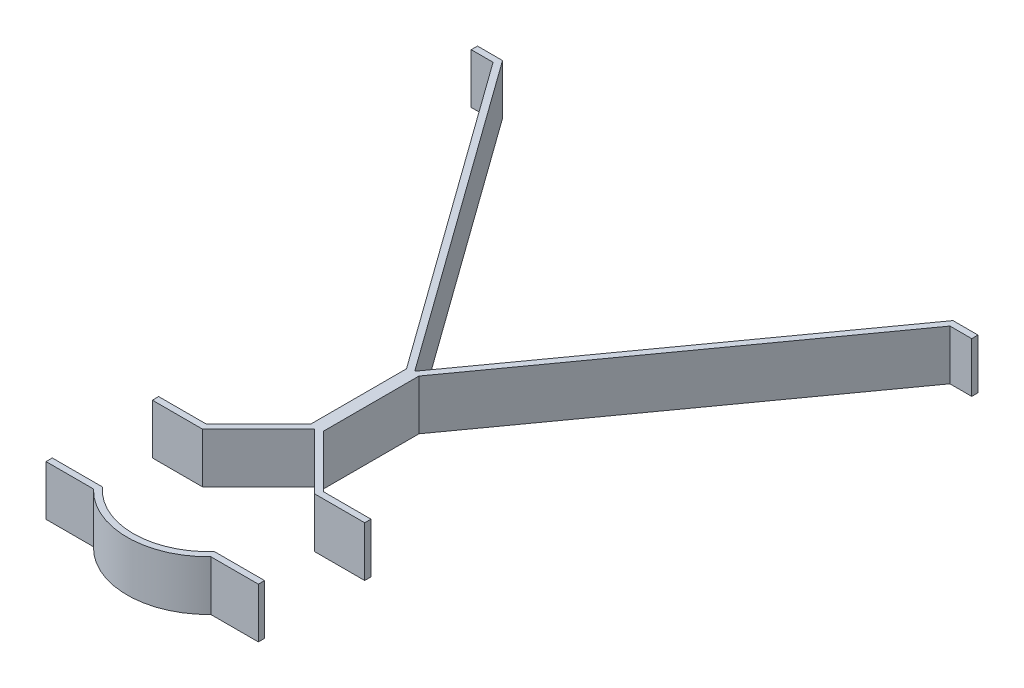
ISO-10303-21;
HEADER;
FILE_DESCRIPTION(('STEP AP214'),'2;1');
FILE_NAME('part.step','',(''),(''),'','','');
FILE_SCHEMA(('AUTOMOTIVE_DESIGN { 1 0 10303 214 1 1 1 1 }'));
ENDSEC;
DATA;
#1=APPLICATION_CONTEXT('core data for automotive mechanical design processes');
#2=APPLICATION_PROTOCOL_DEFINITION('international standard','automotive_design',2000,#1);
#3=PRODUCT_CONTEXT('',#1,'mechanical');
#4=PRODUCT('Part','Part','',(#3));
#5=PRODUCT_RELATED_PRODUCT_CATEGORY('part','',(#4));
#6=PRODUCT_DEFINITION_FORMATION('','',#4);
#7=PRODUCT_DEFINITION_CONTEXT('part definition',#1,'design');
#8=PRODUCT_DEFINITION('design','',#6,#7);
#9=PRODUCT_DEFINITION_SHAPE('','',#8);
#10=(LENGTH_UNIT() NAMED_UNIT(*) SI_UNIT(.MILLI.,.METRE.));
#11=(NAMED_UNIT(*) PLANE_ANGLE_UNIT() SI_UNIT($,.RADIAN.));
#12=(NAMED_UNIT(*) SI_UNIT($,.STERADIAN.) SOLID_ANGLE_UNIT());
#13=UNCERTAINTY_MEASURE_WITH_UNIT(LENGTH_MEASURE(1.E-05),#10,'distance_accuracy_value','');
#14=(GEOMETRIC_REPRESENTATION_CONTEXT(3) GLOBAL_UNCERTAINTY_ASSIGNED_CONTEXT((#13)) GLOBAL_UNIT_ASSIGNED_CONTEXT((#10,
#11,#12)) REPRESENTATION_CONTEXT('',''));
#15=CARTESIAN_POINT('',(0.,0.,0.));
#16=DIRECTION('',(0.,0.,1.));
#17=DIRECTION('',(1.,0.,0.));
#18=AXIS2_PLACEMENT_3D('',#15,#16,#17);
#19=CARTESIAN_POINT('',(0.,12.7,107.856536726415));
#20=DIRECTION('',(0.,0.,-1.));
#21=DIRECTION('',(-1.,0.,0.));
#22=AXIS2_PLACEMENT_3D('',#19,#20,#21);
#23=PLANE('',#22);
#24=DIRECTION('',(1.,0.,0.));
#25=VECTOR('',#24,1.);
#26=CARTESIAN_POINT('',(0.,-12.7,107.856536726415));
#27=LINE('',#26,#25);
#28=CARTESIAN_POINT('',(-53.8815367264149,-12.7,107.856536726415));
#29=VERTEX_POINT('',#28);
#30=CARTESIAN_POINT('',(-29.7841400748788,-12.7,107.856536726415));
#31=VERTEX_POINT('',#30);
#32=EDGE_CURVE('E140',#29,#31,#27,.T.);
#33=ORIENTED_EDGE('',*,*,#32,.T.);
#34=DIRECTION('',(0.,-1.,0.));
#35=VECTOR('',#34,1.);
#36=CARTESIAN_POINT('',(-29.7841400748788,12.7,107.856536726415));
#37=LINE('',#36,#35);
#38=CARTESIAN_POINT('',(-29.7841400748788,12.7,107.856536726415));
#39=VERTEX_POINT('',#38);
#40=EDGE_CURVE('E12',#39,#31,#37,.T.);
#41=ORIENTED_EDGE('',*,*,#40,.F.);
#42=DIRECTION('',(1.,0.,0.));
#43=VECTOR('',#42,1.);
#44=CARTESIAN_POINT('',(0.,12.7,107.856536726415));
#45=LINE('',#44,#43);
#46=CARTESIAN_POINT('',(-53.8815367264149,12.7,107.856536726415));
#47=VERTEX_POINT('',#46);
#48=EDGE_CURVE('E158',#47,#39,#45,.T.);
#49=ORIENTED_EDGE('',*,*,#48,.F.);
#50=DIRECTION('',(0.,-1.,0.));
#51=VECTOR('',#50,1.);
#52=CARTESIAN_POINT('',(-53.8815367264149,12.7,107.856536726415));
#53=LINE('',#52,#51);
#54=EDGE_CURVE('E136',#47,#29,#53,.T.);
#55=ORIENTED_EDGE('',*,*,#54,.T.);
#56=EDGE_LOOP('',(#33,#41,#49,#55));
#57=FACE_BOUND('',#56,.T.);
#58=ADVANCED_FACE('F45',(#57),#23,.F.);
#59=CARTESIAN_POINT('',(0.,12.7,79.2815367264148));
#60=DIRECTION('',(0.,-1.,0.));
#61=DIRECTION('',(0.,0.,-1.));
#62=AXIS2_PLACEMENT_3D('',#59,#60,#61);
#63=CYLINDRICAL_SURFACE('',#62,41.275);
#64=CARTESIAN_POINT('',(0.,-12.7,79.2815367264148));
#65=DIRECTION('',(0.,1.,0.));
#66=DIRECTION('',(0.,0.,1.));
#67=AXIS2_PLACEMENT_3D('',#64,#65,#66);
#68=CIRCLE('',#67,41.275);
#69=CARTESIAN_POINT('',(29.7841400748787,-12.7,107.856536726415));
#70=VERTEX_POINT('',#69);
#71=EDGE_CURVE('E143',#31,#70,#68,.T.);
#72=ORIENTED_EDGE('',*,*,#71,.T.);
#73=DIRECTION('',(0.,-1.,0.));
#74=VECTOR('',#73,1.);
#75=CARTESIAN_POINT('',(29.7841400748787,12.7,107.856536726415));
#76=LINE('',#75,#74);
#77=CARTESIAN_POINT('',(29.7841400748787,12.7,107.856536726415));
#78=VERTEX_POINT('',#77);
#79=EDGE_CURVE('E53',#78,#70,#76,.T.);
#80=ORIENTED_EDGE('',*,*,#79,.F.);
#81=CARTESIAN_POINT('',(0.,12.7,79.2815367264148));
#82=DIRECTION('',(0.,1.,0.));
#83=DIRECTION('',(0.,0.,1.));
#84=AXIS2_PLACEMENT_3D('',#81,#82,#83);
#85=CIRCLE('',#84,41.275);
#86=EDGE_CURVE('E100',#39,#78,#85,.T.);
#87=ORIENTED_EDGE('',*,*,#86,.F.);
#88=ORIENTED_EDGE('',*,*,#40,.T.);
#89=EDGE_LOOP('',(#72,#80,#87,#88));
#90=FACE_BOUND('',#89,.T.);
#91=ADVANCED_FACE('F188',(#90),#63,.T.);
#92=CARTESIAN_POINT('',(0.,12.7,107.856536726415));
#93=DIRECTION('',(0.,0.,-1.));
#94=DIRECTION('',(-1.,0.,0.));
#95=AXIS2_PLACEMENT_3D('',#92,#93,#94);
#96=PLANE('',#95);
#97=DIRECTION('',(1.,0.,0.));
#98=VECTOR('',#97,1.);
#99=CARTESIAN_POINT('',(0.,-12.7,107.856536726415));
#100=LINE('',#99,#98);
#101=CARTESIAN_POINT('',(53.8815367264149,-12.7,107.856536726415));
#102=VERTEX_POINT('',#101);
#103=EDGE_CURVE('E145',#70,#102,#100,.T.);
#104=ORIENTED_EDGE('',*,*,#103,.T.);
#105=DIRECTION('',(0.,-1.,0.));
#106=VECTOR('',#105,1.);
#107=CARTESIAN_POINT('',(53.8815367264149,12.7,107.856536726415));
#108=LINE('',#107,#106);
#109=CARTESIAN_POINT('',(53.8815367264149,12.7,107.856536726415));
#110=VERTEX_POINT('',#109);
#111=EDGE_CURVE('E164',#110,#102,#108,.T.);
#112=ORIENTED_EDGE('',*,*,#111,.F.);
#113=DIRECTION('',(1.,0.,0.));
#114=VECTOR('',#113,1.);
#115=CARTESIAN_POINT('',(0.,12.7,107.856536726415));
#116=LINE('',#115,#114);
#117=EDGE_CURVE('E171',#78,#110,#116,.T.);
#118=ORIENTED_EDGE('',*,*,#117,.F.);
#119=ORIENTED_EDGE('',*,*,#79,.T.);
#120=EDGE_LOOP('',(#104,#112,#118,#119));
#121=FACE_BOUND('',#120,.T.);
#122=ADVANCED_FACE('F169',(#121),#96,.F.);
#123=CARTESIAN_POINT('',(53.8815367264149,12.7,0.));
#124=DIRECTION('',(1.,0.,0.));
#125=DIRECTION('',(0.,0.,-1.));
#126=AXIS2_PLACEMENT_3D('',#123,#124,#125);
#127=PLANE('',#126);
#128=DIRECTION('',(0.,0.,1.));
#129=VECTOR('',#128,1.);
#130=CARTESIAN_POINT('',(53.8815367264149,-12.7,0.));
#131=LINE('',#130,#129);
#132=CARTESIAN_POINT('',(53.8815367264149,-12.7,104.681536726415));
#133=VERTEX_POINT('',#132);
#134=EDGE_CURVE('E148',#133,#102,#131,.T.);
#135=ORIENTED_EDGE('',*,*,#134,.F.);
#136=DIRECTION('',(0.,-1.,0.));
#137=VECTOR('',#136,1.);
#138=CARTESIAN_POINT('',(53.8815367264149,12.7,104.681536726415));
#139=LINE('',#138,#137);
#140=CARTESIAN_POINT('',(53.8815367264149,12.7,104.681536726415));
#141=VERTEX_POINT('',#140);
#142=EDGE_CURVE('E162',#141,#133,#139,.T.);
#143=ORIENTED_EDGE('',*,*,#142,.F.);
#144=DIRECTION('',(0.,0.,1.));
#145=VECTOR('',#144,1.);
#146=CARTESIAN_POINT('',(53.8815367264149,12.7,0.));
#147=LINE('',#146,#145);
#148=EDGE_CURVE('E180',#141,#110,#147,.T.);
#149=ORIENTED_EDGE('',*,*,#148,.T.);
#150=ORIENTED_EDGE('',*,*,#111,.T.);
#151=EDGE_LOOP('',(#135,#143,#149,#150));
#152=FACE_BOUND('',#151,.T.);
#153=ADVANCED_FACE('F178',(#152),#127,.T.);
#154=CARTESIAN_POINT('',(0.,12.7,104.681536726415));
#155=DIRECTION('',(0.,0.,-1.));
#156=DIRECTION('',(-1.,0.,0.));
#157=AXIS2_PLACEMENT_3D('',#154,#155,#156);
#158=PLANE('',#157);
#159=DIRECTION('',(1.,0.,0.));
#160=VECTOR('',#159,1.);
#161=CARTESIAN_POINT('',(0.,-12.7,104.681536726415));
#162=LINE('',#161,#160);
#163=CARTESIAN_POINT('',(28.3980633142473,-12.7,104.681536726415));
#164=VERTEX_POINT('',#163);
#165=EDGE_CURVE('E151',#164,#133,#162,.T.);
#166=ORIENTED_EDGE('',*,*,#165,.F.);
#167=DIRECTION('',(0.,-1.,0.));
#168=VECTOR('',#167,1.);
#169=CARTESIAN_POINT('',(28.3980633142473,12.7,104.681536726415));
#170=LINE('',#169,#168);
#171=CARTESIAN_POINT('',(28.3980633142473,12.7,104.681536726415));
#172=VERTEX_POINT('',#171);
#173=EDGE_CURVE('E125',#172,#164,#170,.T.);
#174=ORIENTED_EDGE('',*,*,#173,.F.);
#175=DIRECTION('',(1.,0.,0.));
#176=VECTOR('',#175,1.);
#177=CARTESIAN_POINT('',(0.,12.7,104.681536726415));
#178=LINE('',#177,#176);
#179=EDGE_CURVE('E132',#172,#141,#178,.T.);
#180=ORIENTED_EDGE('',*,*,#179,.T.);
#181=ORIENTED_EDGE('',*,*,#142,.T.);
#182=EDGE_LOOP('',(#166,#174,#180,#181));
#183=FACE_BOUND('',#182,.T.);
#184=ADVANCED_FACE('F198',(#183),#158,.T.);
#185=CARTESIAN_POINT('',(0.,12.7,79.2815367264148));
#186=DIRECTION('',(0.,-1.,0.));
#187=DIRECTION('',(0.,0.,-1.));
#188=AXIS2_PLACEMENT_3D('',#185,#186,#187);
#189=CYLINDRICAL_SURFACE('',#188,38.1);
#190=CARTESIAN_POINT('',(0.,-12.7,79.2815367264148));
#191=DIRECTION('',(0.,1.,0.));
#192=DIRECTION('',(0.,0.,1.));
#193=AXIS2_PLACEMENT_3D('',#190,#191,#192);
#194=CIRCLE('',#193,38.1);
#195=CARTESIAN_POINT('',(-28.3980633142473,-12.7,104.681536726415));
#196=VERTEX_POINT('',#195);
#197=EDGE_CURVE('E120',#196,#164,#194,.T.);
#198=ORIENTED_EDGE('',*,*,#197,.F.);
#199=DIRECTION('',(0.,-1.,0.));
#200=VECTOR('',#199,1.);
#201=CARTESIAN_POINT('',(-28.3980633142473,12.7,104.681536726415));
#202=LINE('',#201,#200);
#203=CARTESIAN_POINT('',(-28.3980633142473,12.7,104.681536726415));
#204=VERTEX_POINT('',#203);
#205=EDGE_CURVE('E115',#204,#196,#202,.T.);
#206=ORIENTED_EDGE('',*,*,#205,.F.);
#207=CARTESIAN_POINT('',(0.,12.7,79.2815367264148));
#208=DIRECTION('',(0.,1.,0.));
#209=DIRECTION('',(0.,0.,1.));
#210=AXIS2_PLACEMENT_3D('',#207,#208,#209);
#211=CIRCLE('',#210,38.1);
#212=EDGE_CURVE('E118',#204,#172,#211,.T.);
#213=ORIENTED_EDGE('',*,*,#212,.T.);
#214=ORIENTED_EDGE('',*,*,#173,.T.);
#215=EDGE_LOOP('',(#198,#206,#213,#214));
#216=FACE_BOUND('',#215,.T.);
#217=ADVANCED_FACE('F117',(#216),#189,.F.);
#218=CARTESIAN_POINT('',(0.,12.7,104.681536726415));
#219=DIRECTION('',(0.,0.,-1.));
#220=DIRECTION('',(-1.,0.,0.));
#221=AXIS2_PLACEMENT_3D('',#218,#219,#220);
#222=PLANE('',#221);
#223=DIRECTION('',(1.,0.,0.));
#224=VECTOR('',#223,1.);
#225=CARTESIAN_POINT('',(0.,-12.7,104.681536726415));
#226=LINE('',#225,#224);
#227=CARTESIAN_POINT('',(-53.8815367264149,-12.7,104.681536726415));
#228=VERTEX_POINT('',#227);
#229=EDGE_CURVE('E155',#228,#196,#226,.T.);
#230=ORIENTED_EDGE('',*,*,#229,.F.);
#231=DIRECTION('',(0.,-1.,0.));
#232=VECTOR('',#231,1.);
#233=CARTESIAN_POINT('',(-53.8815367264149,12.7,104.681536726415));
#234=LINE('',#233,#232);
#235=CARTESIAN_POINT('',(-53.8815367264149,12.7,104.681536726415));
#236=VERTEX_POINT('',#235);
#237=EDGE_CURVE('E89',#236,#228,#234,.T.);
#238=ORIENTED_EDGE('',*,*,#237,.F.);
#239=DIRECTION('',(1.,0.,0.));
#240=VECTOR('',#239,1.);
#241=CARTESIAN_POINT('',(0.,12.7,104.681536726415));
#242=LINE('',#241,#240);
#243=EDGE_CURVE('E129',#236,#204,#242,.T.);
#244=ORIENTED_EDGE('',*,*,#243,.T.);
#245=ORIENTED_EDGE('',*,*,#205,.T.);
#246=EDGE_LOOP('',(#230,#238,#244,#245));
#247=FACE_BOUND('',#246,.T.);
#248=ADVANCED_FACE('F134',(#247),#222,.T.);
#249=CARTESIAN_POINT('',(-53.8815367264149,12.7,0.));
#250=DIRECTION('',(1.,0.,0.));
#251=DIRECTION('',(0.,0.,-1.));
#252=AXIS2_PLACEMENT_3D('',#249,#250,#251);
#253=PLANE('',#252);
#254=DIRECTION('',(0.,0.,1.));
#255=VECTOR('',#254,1.);
#256=CARTESIAN_POINT('',(-53.8815367264149,-12.7,0.));
#257=LINE('',#256,#255);
#258=EDGE_CURVE('E92',#228,#29,#257,.T.);
#259=ORIENTED_EDGE('',*,*,#258,.T.);
#260=ORIENTED_EDGE('',*,*,#54,.F.);
#261=DIRECTION('',(0.,0.,1.));
#262=VECTOR('',#261,1.);
#263=CARTESIAN_POINT('',(-53.8815367264149,12.7,0.));
#264=LINE('',#263,#262);
#265=EDGE_CURVE('E61',#236,#47,#264,.T.);
#266=ORIENTED_EDGE('',*,*,#265,.F.);
#267=ORIENTED_EDGE('',*,*,#237,.T.);
#268=EDGE_LOOP('',(#259,#260,#266,#267));
#269=FACE_BOUND('',#268,.T.);
#270=ADVANCED_FACE('F206',(#269),#253,.F.);
#271=CARTESIAN_POINT('',(0.,12.7,0.));
#272=DIRECTION('',(0.,1.,0.));
#273=DIRECTION('',(0.,0.,1.));
#274=AXIS2_PLACEMENT_3D('',#271,#272,#273);
#275=PLANE('',#274);
#276=ORIENTED_EDGE('',*,*,#48,.T.);
#277=ORIENTED_EDGE('',*,*,#86,.T.);
#278=ORIENTED_EDGE('',*,*,#117,.T.);
#279=ORIENTED_EDGE('',*,*,#148,.F.);
#280=ORIENTED_EDGE('',*,*,#179,.F.);
#281=ORIENTED_EDGE('',*,*,#212,.F.);
#282=ORIENTED_EDGE('',*,*,#243,.F.);
#283=ORIENTED_EDGE('',*,*,#265,.T.);
#284=EDGE_LOOP('',(#276,#277,#278,#279,#280,#281,#282,#283));
#285=FACE_BOUND('',#284,.T.);
#286=ADVANCED_FACE('F128',(#285),#275,.T.);
#287=CARTESIAN_POINT('',(0.,-12.7,0.));
#288=DIRECTION('',(0.,1.,0.));
#289=DIRECTION('',(0.,0.,1.));
#290=AXIS2_PLACEMENT_3D('',#287,#288,#289);
#291=PLANE('',#290);
#292=ORIENTED_EDGE('',*,*,#32,.F.);
#293=ORIENTED_EDGE('',*,*,#258,.F.);
#294=ORIENTED_EDGE('',*,*,#229,.T.);
#295=ORIENTED_EDGE('',*,*,#197,.T.);
#296=ORIENTED_EDGE('',*,*,#165,.T.);
#297=ORIENTED_EDGE('',*,*,#134,.T.);
#298=ORIENTED_EDGE('',*,*,#103,.F.);
#299=ORIENTED_EDGE('',*,*,#71,.F.);
#300=EDGE_LOOP('',(#292,#293,#294,#295,#296,#297,#298,#299));
#301=FACE_BOUND('',#300,.T.);
#302=ADVANCED_FACE('F174',(#301),#291,.F.);
#303=CLOSED_SHELL('',(#58,#91,#122,#153,#184,#217,#248,#270,#286,#302));
#304=MANIFOLD_SOLID_BREP('B2',#303);
#305=CARTESIAN_POINT('',(-10.4549359697327,12.7,10.4549359697327));
#306=DIRECTION('',(0.707106781186548,0.,-0.707106781186548));
#307=DIRECTION('',(-0.707106781186548,0.,-0.707106781186548));
#308=AXIS2_PLACEMENT_3D('',#305,#306,#307);
#309=PLANE('',#308);
#310=DIRECTION('',(0.707106781186548,0.,0.707106781186548));
#311=VECTOR('',#310,1.);
#312=CARTESIAN_POINT('',(-10.4549359697327,-12.7,10.4549359697327));
#313=LINE('',#312,#311);
#314=CARTESIAN_POINT('',(3.175,-12.7,24.0848719394654));
#315=VERTEX_POINT('',#314);
#316=CARTESIAN_POINT('',(29.7966647869494,-12.7,50.7065367264148));
#317=VERTEX_POINT('',#316);
#318=EDGE_CURVE('E452',#315,#317,#313,.T.);
#319=ORIENTED_EDGE('',*,*,#318,.F.);
#320=DIRECTION('',(0.,-1.,0.));
#321=VECTOR('',#320,1.);
#322=CARTESIAN_POINT('',(3.175,12.7,24.0848719394654));
#323=LINE('',#322,#321);
#324=CARTESIAN_POINT('',(3.175,12.7,24.0848719394654));
#325=VERTEX_POINT('',#324);
#326=EDGE_CURVE('E43',#325,#315,#323,.T.);
#327=ORIENTED_EDGE('',*,*,#326,.F.);
#328=DIRECTION('',(0.707106781186548,0.,0.707106781186548));
#329=VECTOR('',#328,1.);
#330=CARTESIAN_POINT('',(-10.4549359697327,12.7,10.4549359697327));
#331=LINE('',#330,#329);
#332=CARTESIAN_POINT('',(29.7966647869494,12.7,50.7065367264148));
#333=VERTEX_POINT('',#332);
#334=EDGE_CURVE('E509',#325,#333,#331,.T.);
#335=ORIENTED_EDGE('',*,*,#334,.T.);
#336=DIRECTION('',(0.,-1.,0.));
#337=VECTOR('',#336,1.);
#338=CARTESIAN_POINT('',(29.7966647869494,12.7,50.7065367264148));
#339=LINE('',#338,#337);
#340=EDGE_CURVE('E289',#333,#317,#339,.T.);
#341=ORIENTED_EDGE('',*,*,#340,.T.);
#342=EDGE_LOOP('',(#319,#327,#335,#341));
#343=FACE_BOUND('',#342,.T.);
#344=ADVANCED_FACE('F273',(#343),#309,.T.);
#345=CARTESIAN_POINT('',(3.175,12.7,0.));
#346=DIRECTION('',(-1.,0.,0.));
#347=DIRECTION('',(0.,0.,1.));
#348=AXIS2_PLACEMENT_3D('',#345,#346,#347);
#349=PLANE('',#348);
#350=DIRECTION('',(0.,0.,-1.));
#351=VECTOR('',#350,1.);
#352=CARTESIAN_POINT('',(3.175,-12.7,0.));
#353=LINE('',#352,#351);
#354=CARTESIAN_POINT('',(3.17500000000002,-12.7,-24.37640278133));
#355=VERTEX_POINT('',#354);
#356=EDGE_CURVE('E454',#315,#355,#353,.T.);
#357=ORIENTED_EDGE('',*,*,#356,.T.);
#358=DIRECTION('',(0.,-1.,0.));
#359=VECTOR('',#358,1.);
#360=CARTESIAN_POINT('',(3.17500000000002,12.7,-24.37640278133));
#361=LINE('',#360,#359);
#362=CARTESIAN_POINT('',(3.17500000000002,12.7,-24.37640278133));
#363=VERTEX_POINT('',#362);
#364=EDGE_CURVE('E281',#363,#355,#361,.T.);
#365=ORIENTED_EDGE('',*,*,#364,.F.);
#366=DIRECTION('',(0.,0.,-1.));
#367=VECTOR('',#366,1.);
#368=CARTESIAN_POINT('',(3.175,12.7,0.));
#369=LINE('',#368,#367);
#370=EDGE_CURVE('E570',#325,#363,#369,.T.);
#371=ORIENTED_EDGE('',*,*,#370,.F.);
#372=ORIENTED_EDGE('',*,*,#326,.T.);
#373=EDGE_LOOP('',(#357,#365,#371,#372));
#374=FACE_BOUND('',#373,.T.);
#375=ADVANCED_FACE('F557',(#374),#349,.F.);
#376=CARTESIAN_POINT('',(-9.46486786910494,12.7,-6.81069510285979));
#377=DIRECTION('',(0.811697368777209,0.,0.584078232362888));
#378=DIRECTION('',(0.584078232362888,0.,-0.811697368777209));
#379=AXIS2_PLACEMENT_3D('',#376,#377,#378);
#380=PLANE('',#379);
#381=DIRECTION('',(-0.584078232362888,0.,0.811697368777209));
#382=VECTOR('',#381,1.);
#383=CARTESIAN_POINT('',(-9.46486786910494,-12.7,-6.81069510285979));
#384=LINE('',#383,#382);
#385=CARTESIAN_POINT('',(115.926901432781,-12.7,-181.068463273585));
#386=VERTEX_POINT('',#385);
#387=EDGE_CURVE('E457',#386,#355,#384,.T.);
#388=ORIENTED_EDGE('',*,*,#387,.F.);
#389=DIRECTION('',(0.,-1.,0.));
#390=VECTOR('',#389,1.);
#391=CARTESIAN_POINT('',(115.926901432781,12.7,-181.068463273585));
#392=LINE('',#391,#390);
#393=CARTESIAN_POINT('',(115.926901432781,12.7,-181.068463273585));
#394=VERTEX_POINT('',#393);
#395=EDGE_CURVE('E547',#394,#386,#392,.T.);
#396=ORIENTED_EDGE('',*,*,#395,.F.);
#397=DIRECTION('',(-0.584078232362888,0.,0.811697368777209));
#398=VECTOR('',#397,1.);
#399=CARTESIAN_POINT('',(-9.46486786910494,12.7,-6.81069510285979));
#400=LINE('',#399,#398);
#401=EDGE_CURVE('E554',#394,#363,#400,.T.);
#402=ORIENTED_EDGE('',*,*,#401,.T.);
#403=ORIENTED_EDGE('',*,*,#364,.T.);
#404=EDGE_LOOP('',(#388,#396,#402,#403));
#405=FACE_BOUND('',#404,.T.);
#406=ADVANCED_FACE('F552',(#405),#380,.T.);
#407=CARTESIAN_POINT('',(0.,12.7,-181.068463273585));
#408=DIRECTION('',(0.,0.,1.));
#409=DIRECTION('',(1.,0.,0.));
#410=AXIS2_PLACEMENT_3D('',#407,#408,#409);
#411=PLANE('',#410);
#412=DIRECTION('',(-1.,0.,0.));
#413=VECTOR('',#412,1.);
#414=CARTESIAN_POINT('',(0.,-12.7,-181.068463273585));
#415=LINE('',#414,#413);
#416=CARTESIAN_POINT('',(127.,-12.7,-181.068463273585));
#417=VERTEX_POINT('',#416);
#418=EDGE_CURVE('E460',#417,#386,#415,.T.);
#419=ORIENTED_EDGE('',*,*,#418,.F.);
#420=DIRECTION('',(0.,-1.,0.));
#421=VECTOR('',#420,1.);
#422=CARTESIAN_POINT('',(127.,12.7,-181.068463273585));
#423=LINE('',#422,#421);
#424=CARTESIAN_POINT('',(127.,12.7,-181.068463273585));
#425=VERTEX_POINT('',#424);
#426=EDGE_CURVE('E545',#425,#417,#423,.T.);
#427=ORIENTED_EDGE('',*,*,#426,.F.);
#428=DIRECTION('',(-1.,0.,0.));
#429=VECTOR('',#428,1.);
#430=CARTESIAN_POINT('',(0.,12.7,-181.068463273585));
#431=LINE('',#430,#429);
#432=EDGE_CURVE('E567',#425,#394,#431,.T.);
#433=ORIENTED_EDGE('',*,*,#432,.T.);
#434=ORIENTED_EDGE('',*,*,#395,.T.);
#435=EDGE_LOOP('',(#419,#427,#433,#434));
#436=FACE_BOUND('',#435,.T.);
#437=ADVANCED_FACE('F564',(#436),#411,.T.);
#438=CARTESIAN_POINT('',(127.,12.7,0.));
#439=DIRECTION('',(1.,0.,0.));
#440=DIRECTION('',(0.,0.,-1.));
#441=AXIS2_PLACEMENT_3D('',#438,#439,#440);
#442=PLANE('',#441);
#443=DIRECTION('',(0.,0.,1.));
#444=VECTOR('',#443,1.);
#445=CARTESIAN_POINT('',(127.,-12.7,0.));
#446=LINE('',#445,#444);
#447=CARTESIAN_POINT('',(127.,-12.7,-184.243463273585));
#448=VERTEX_POINT('',#447);
#449=EDGE_CURVE('E463',#448,#417,#446,.T.);
#450=ORIENTED_EDGE('',*,*,#449,.F.);
#451=DIRECTION('',(0.,-1.,0.));
#452=VECTOR('',#451,1.);
#453=CARTESIAN_POINT('',(127.,12.7,-184.243463273585));
#454=LINE('',#453,#452);
#455=CARTESIAN_POINT('',(127.,12.7,-184.243463273585));
#456=VERTEX_POINT('',#455);
#457=EDGE_CURVE('E543',#456,#448,#454,.T.);
#458=ORIENTED_EDGE('',*,*,#457,.F.);
#459=DIRECTION('',(0.,0.,1.));
#460=VECTOR('',#459,1.);
#461=CARTESIAN_POINT('',(127.,12.7,0.));
#462=LINE('',#461,#460);
#463=EDGE_CURVE('E572',#456,#425,#462,.T.);
#464=ORIENTED_EDGE('',*,*,#463,.T.);
#465=ORIENTED_EDGE('',*,*,#426,.T.);
#466=EDGE_LOOP('',(#450,#458,#464,#465));
#467=FACE_BOUND('',#466,.T.);
#468=ADVANCED_FACE('F794',(#467),#442,.T.);
#469=CARTESIAN_POINT('',(0.,12.7,-184.243463273585));
#470=DIRECTION('',(0.,0.,1.));
#471=DIRECTION('',(1.,0.,0.));
#472=AXIS2_PLACEMENT_3D('',#469,#470,#471);
#473=PLANE('',#472);
#474=DIRECTION('',(-1.,0.,0.));
#475=VECTOR('',#474,1.);
#476=CARTESIAN_POINT('',(0.,-12.7,-184.243463273585));
#477=LINE('',#476,#475);
#478=CARTESIAN_POINT('',(114.3,-12.7,-184.243463273585));
#479=VERTEX_POINT('',#478);
#480=EDGE_CURVE('E466',#448,#479,#477,.T.);
#481=ORIENTED_EDGE('',*,*,#480,.T.);
#482=DIRECTION('',(0.,-1.,0.));
#483=VECTOR('',#482,1.);
#484=CARTESIAN_POINT('',(114.3,12.7,-184.243463273585));
#485=LINE('',#484,#483);
#486=CARTESIAN_POINT('',(114.3,12.7,-184.243463273585));
#487=VERTEX_POINT('',#486);
#488=EDGE_CURVE('E540',#487,#479,#485,.T.);
#489=ORIENTED_EDGE('',*,*,#488,.F.);
#490=DIRECTION('',(-1.,0.,0.));
#491=VECTOR('',#490,1.);
#492=CARTESIAN_POINT('',(0.,12.7,-184.243463273585));
#493=LINE('',#492,#491);
#494=EDGE_CURVE('E578',#456,#487,#493,.T.);
#495=ORIENTED_EDGE('',*,*,#494,.F.);
#496=ORIENTED_EDGE('',*,*,#457,.T.);
#497=EDGE_LOOP('',(#481,#489,#495,#496));
#498=FACE_BOUND('',#497,.T.);
#499=ADVANCED_FACE('F784',(#498),#473,.F.);
#500=CARTESIAN_POINT('',(-12.0420070149726,12.7,-8.66514349061196));
#501=DIRECTION('',(0.811697368777209,0.,0.584078232362888));
#502=DIRECTION('',(0.584078232362888,0.,-0.811697368777209));
#503=AXIS2_PLACEMENT_3D('',#500,#501,#502);
#504=PLANE('',#503);
#505=DIRECTION('',(-0.584078232362888,0.,0.811697368777209));
#506=VECTOR('',#505,1.);
#507=CARTESIAN_POINT('',(-12.0420070149726,-12.7,-8.66514349061196));
#508=LINE('',#507,#506);
#509=CARTESIAN_POINT('',(0.,-12.7,-25.4));
#510=VERTEX_POINT('',#509);
#511=EDGE_CURVE('E468',#479,#510,#508,.T.);
#512=ORIENTED_EDGE('',*,*,#511,.T.);
#513=DIRECTION('',(0.,-1.,0.));
#514=VECTOR('',#513,1.);
#515=CARTESIAN_POINT('',(0.,12.7,-25.4));
#516=LINE('',#515,#514);
#517=CARTESIAN_POINT('',(0.,12.7,-25.4));
#518=VERTEX_POINT('',#517);
#519=EDGE_CURVE('E538',#518,#510,#516,.T.);
#520=ORIENTED_EDGE('',*,*,#519,.F.);
#521=DIRECTION('',(-0.584078232362888,0.,0.811697368777209));
#522=VECTOR('',#521,1.);
#523=CARTESIAN_POINT('',(-12.0420070149726,12.7,-8.66514349061196));
#524=LINE('',#523,#522);
#525=EDGE_CURVE('E580',#487,#518,#524,.T.);
#526=ORIENTED_EDGE('',*,*,#525,.F.);
#527=ORIENTED_EDGE('',*,*,#488,.T.);
#528=EDGE_LOOP('',(#512,#520,#526,#527));
#529=FACE_BOUND('',#528,.T.);
#530=ADVANCED_FACE('F774',(#529),#504,.F.);
#531=CARTESIAN_POINT('',(12.0420070149726,12.7,-8.66514349061196));
#532=DIRECTION('',(0.811697368777209,0.,-0.584078232362888));
#533=DIRECTION('',(-0.584078232362888,0.,-0.811697368777209));
#534=AXIS2_PLACEMENT_3D('',#531,#532,#533);
#535=PLANE('',#534);
#536=DIRECTION('',(0.584078232362888,0.,0.811697368777209));
#537=VECTOR('',#536,1.);
#538=CARTESIAN_POINT('',(12.0420070149726,-12.7,-8.66514349061196));
#539=LINE('',#538,#537);
#540=CARTESIAN_POINT('',(-114.3,-12.7,-184.243463273585));
#541=VERTEX_POINT('',#540);
#542=EDGE_CURVE('E471',#541,#510,#539,.T.);
#543=ORIENTED_EDGE('',*,*,#542,.F.);
#544=DIRECTION('',(0.,-1.,0.));
#545=VECTOR('',#544,1.);
#546=CARTESIAN_POINT('',(-114.3,12.7,-184.243463273585));
#547=LINE('',#546,#545);
#548=CARTESIAN_POINT('',(-114.3,12.7,-184.243463273585));
#549=VERTEX_POINT('',#548);
#550=EDGE_CURVE('E536',#549,#541,#547,.T.);
#551=ORIENTED_EDGE('',*,*,#550,.F.);
#552=DIRECTION('',(0.584078232362888,0.,0.811697368777209));
#553=VECTOR('',#552,1.);
#554=CARTESIAN_POINT('',(12.0420070149726,12.7,-8.66514349061196));
#555=LINE('',#554,#553);
#556=EDGE_CURVE('E582',#549,#518,#555,.T.);
#557=ORIENTED_EDGE('',*,*,#556,.T.);
#558=ORIENTED_EDGE('',*,*,#519,.T.);
#559=EDGE_LOOP('',(#543,#551,#557,#558));
#560=FACE_BOUND('',#559,.T.);
#561=ADVANCED_FACE('F764',(#560),#535,.T.);
#562=CARTESIAN_POINT('',(0.,12.7,-184.243463273585));
#563=DIRECTION('',(0.,0.,-1.));
#564=DIRECTION('',(-1.,0.,0.));
#565=AXIS2_PLACEMENT_3D('',#562,#563,#564);
#566=PLANE('',#565);
#567=DIRECTION('',(1.,0.,0.));
#568=VECTOR('',#567,1.);
#569=CARTESIAN_POINT('',(0.,-12.7,-184.243463273585));
#570=LINE('',#569,#568);
#571=CARTESIAN_POINT('',(-127.,-12.7,-184.243463273585));
#572=VERTEX_POINT('',#571);
#573=EDGE_CURVE('E474',#572,#541,#570,.T.);
#574=ORIENTED_EDGE('',*,*,#573,.F.);
#575=DIRECTION('',(0.,-1.,0.));
#576=VECTOR('',#575,1.);
#577=CARTESIAN_POINT('',(-127.,12.7,-184.243463273585));
#578=LINE('',#577,#576);
#579=CARTESIAN_POINT('',(-127.,12.7,-184.243463273585));
#580=VERTEX_POINT('',#579);
#581=EDGE_CURVE('E534',#580,#572,#578,.T.);
#582=ORIENTED_EDGE('',*,*,#581,.F.);
#583=DIRECTION('',(1.,0.,0.));
#584=VECTOR('',#583,1.);
#585=CARTESIAN_POINT('',(0.,12.7,-184.243463273585));
#586=LINE('',#585,#584);
#587=EDGE_CURVE('E585',#580,#549,#586,.T.);
#588=ORIENTED_EDGE('',*,*,#587,.T.);
#589=ORIENTED_EDGE('',*,*,#550,.T.);
#590=EDGE_LOOP('',(#574,#582,#588,#589));
#591=FACE_BOUND('',#590,.T.);
#592=ADVANCED_FACE('F754',(#591),#566,.T.);
#593=CARTESIAN_POINT('',(-127.,12.7,0.));
#594=DIRECTION('',(1.,0.,0.));
#595=DIRECTION('',(0.,0.,-1.));
#596=AXIS2_PLACEMENT_3D('',#593,#594,#595);
#597=PLANE('',#596);
#598=DIRECTION('',(0.,0.,1.));
#599=VECTOR('',#598,1.);
#600=CARTESIAN_POINT('',(-127.,-12.7,0.));
#601=LINE('',#600,#599);
#602=CARTESIAN_POINT('',(-127.,-12.7,-181.068463273585));
#603=VERTEX_POINT('',#602);
#604=EDGE_CURVE('E477',#572,#603,#601,.T.);
#605=ORIENTED_EDGE('',*,*,#604,.T.);
#606=DIRECTION('',(0.,-1.,0.));
#607=VECTOR('',#606,1.);
#608=CARTESIAN_POINT('',(-127.,12.7,-181.068463273585));
#609=LINE('',#608,#607);
#610=CARTESIAN_POINT('',(-127.,12.7,-181.068463273585));
#611=VERTEX_POINT('',#610);
#612=EDGE_CURVE('E531',#611,#603,#609,.T.);
#613=ORIENTED_EDGE('',*,*,#612,.F.);
#614=DIRECTION('',(0.,0.,1.));
#615=VECTOR('',#614,1.);
#616=CARTESIAN_POINT('',(-127.,12.7,0.));
#617=LINE('',#616,#615);
#618=EDGE_CURVE('E588',#580,#611,#617,.T.);
#619=ORIENTED_EDGE('',*,*,#618,.F.);
#620=ORIENTED_EDGE('',*,*,#581,.T.);
#621=EDGE_LOOP('',(#605,#613,#619,#620));
#622=FACE_BOUND('',#621,.T.);
#623=ADVANCED_FACE('F744',(#622),#597,.F.);
#624=CARTESIAN_POINT('',(0.,12.7,-181.068463273585));
#625=DIRECTION('',(0.,0.,-1.));
#626=DIRECTION('',(-1.,0.,0.));
#627=AXIS2_PLACEMENT_3D('',#624,#625,#626);
#628=PLANE('',#627);
#629=DIRECTION('',(1.,0.,0.));
#630=VECTOR('',#629,1.);
#631=CARTESIAN_POINT('',(0.,-12.7,-181.068463273585));
#632=LINE('',#631,#630);
#633=CARTESIAN_POINT('',(-115.926901432781,-12.7,-181.068463273585));
#634=VERTEX_POINT('',#633);
#635=EDGE_CURVE('E479',#603,#634,#632,.T.);
#636=ORIENTED_EDGE('',*,*,#635,.T.);
#637=DIRECTION('',(0.,-1.,0.));
#638=VECTOR('',#637,1.);
#639=CARTESIAN_POINT('',(-115.926901432781,12.7,-181.068463273585));
#640=LINE('',#639,#638);
#641=CARTESIAN_POINT('',(-115.926901432781,12.7,-181.068463273585));
#642=VERTEX_POINT('',#641);
#643=EDGE_CURVE('E528',#642,#634,#640,.T.);
#644=ORIENTED_EDGE('',*,*,#643,.F.);
#645=DIRECTION('',(1.,0.,0.));
#646=VECTOR('',#645,1.);
#647=CARTESIAN_POINT('',(0.,12.7,-181.068463273585));
#648=LINE('',#647,#646);
#649=EDGE_CURVE('E590',#611,#642,#648,.T.);
#650=ORIENTED_EDGE('',*,*,#649,.F.);
#651=ORIENTED_EDGE('',*,*,#612,.T.);
#652=EDGE_LOOP('',(#636,#644,#650,#651));
#653=FACE_BOUND('',#652,.T.);
#654=ADVANCED_FACE('F734',(#653),#628,.F.);
#655=CARTESIAN_POINT('',(9.46486786910494,12.7,-6.81069510285979));
#656=DIRECTION('',(0.811697368777209,0.,-0.584078232362888));
#657=DIRECTION('',(-0.584078232362888,0.,-0.811697368777209));
#658=AXIS2_PLACEMENT_3D('',#655,#656,#657);
#659=PLANE('',#658);
#660=DIRECTION('',(0.584078232362888,0.,0.811697368777209));
#661=VECTOR('',#660,1.);
#662=CARTESIAN_POINT('',(9.46486786910494,-12.7,-6.81069510285979));
#663=LINE('',#662,#661);
#664=CARTESIAN_POINT('',(-3.17500000000002,-12.7,-24.37640278133));
#665=VERTEX_POINT('',#664);
#666=EDGE_CURVE('E481',#634,#665,#663,.T.);
#667=ORIENTED_EDGE('',*,*,#666,.T.);
#668=DIRECTION('',(0.,-1.,0.));
#669=VECTOR('',#668,1.);
#670=CARTESIAN_POINT('',(-3.17500000000002,12.7,-24.37640278133));
#671=LINE('',#670,#669);
#672=CARTESIAN_POINT('',(-3.17500000000002,12.7,-24.37640278133));
#673=VERTEX_POINT('',#672);
#674=EDGE_CURVE('E526',#673,#665,#671,.T.);
#675=ORIENTED_EDGE('',*,*,#674,.F.);
#676=DIRECTION('',(0.584078232362888,0.,0.811697368777209));
#677=VECTOR('',#676,1.);
#678=CARTESIAN_POINT('',(9.46486786910494,12.7,-6.81069510285979));
#679=LINE('',#678,#677);
#680=EDGE_CURVE('E592',#642,#673,#679,.T.);
#681=ORIENTED_EDGE('',*,*,#680,.F.);
#682=ORIENTED_EDGE('',*,*,#643,.T.);
#683=EDGE_LOOP('',(#667,#675,#681,#682));
#684=FACE_BOUND('',#683,.T.);
#685=ADVANCED_FACE('F724',(#684),#659,.F.);
#686=CARTESIAN_POINT('',(-3.175,12.7,0.));
#687=DIRECTION('',(-1.,0.,0.));
#688=DIRECTION('',(0.,0.,1.));
#689=AXIS2_PLACEMENT_3D('',#686,#687,#688);
#690=PLANE('',#689);
#691=DIRECTION('',(0.,0.,-1.));
#692=VECTOR('',#691,1.);
#693=CARTESIAN_POINT('',(-3.175,-12.7,0.));
#694=LINE('',#693,#692);
#695=CARTESIAN_POINT('',(-3.175,-12.7,24.0848719394654));
#696=VERTEX_POINT('',#695);
#697=EDGE_CURVE('E484',#696,#665,#694,.T.);
#698=ORIENTED_EDGE('',*,*,#697,.F.);
#699=DIRECTION('',(0.,-1.,0.));
#700=VECTOR('',#699,1.);
#701=CARTESIAN_POINT('',(-3.175,12.7,24.0848719394654));
#702=LINE('',#701,#700);
#703=CARTESIAN_POINT('',(-3.175,12.7,24.0848719394654));
#704=VERTEX_POINT('',#703);
#705=EDGE_CURVE('E524',#704,#696,#702,.T.);
#706=ORIENTED_EDGE('',*,*,#705,.F.);
#707=DIRECTION('',(0.,0.,-1.));
#708=VECTOR('',#707,1.);
#709=CARTESIAN_POINT('',(-3.175,12.7,0.));
#710=LINE('',#709,#708);
#711=EDGE_CURVE('E594',#704,#673,#710,.T.);
#712=ORIENTED_EDGE('',*,*,#711,.T.);
#713=ORIENTED_EDGE('',*,*,#674,.T.);
#714=EDGE_LOOP('',(#698,#706,#712,#713));
#715=FACE_BOUND('',#714,.T.);
#716=ADVANCED_FACE('F714',(#715),#690,.T.);
#717=CARTESIAN_POINT('',(10.4549359697327,12.7,10.4549359697327));
#718=DIRECTION('',(0.707106781186548,0.,0.707106781186548));
#719=DIRECTION('',(0.707106781186548,0.,-0.707106781186548));
#720=AXIS2_PLACEMENT_3D('',#717,#718,#719);
#721=PLANE('',#720);
#722=DIRECTION('',(-0.707106781186548,0.,0.707106781186548));
#723=VECTOR('',#722,1.);
#724=CARTESIAN_POINT('',(10.4549359697327,-12.7,10.4549359697327));
#725=LINE('',#724,#723);
#726=CARTESIAN_POINT('',(-29.7966647869494,-12.7,50.7065367264148));
#727=VERTEX_POINT('',#726);
#728=EDGE_CURVE('E487',#696,#727,#725,.T.);
#729=ORIENTED_EDGE('',*,*,#728,.T.);
#730=DIRECTION('',(0.,-1.,0.));
#731=VECTOR('',#730,1.);
#732=CARTESIAN_POINT('',(-29.7966647869494,12.7,50.7065367264148));
#733=LINE('',#732,#731);
#734=CARTESIAN_POINT('',(-29.7966647869494,12.7,50.7065367264148));
#735=VERTEX_POINT('',#734);
#736=EDGE_CURVE('E521',#735,#727,#733,.T.);
#737=ORIENTED_EDGE('',*,*,#736,.F.);
#738=DIRECTION('',(-0.707106781186548,0.,0.707106781186548));
#739=VECTOR('',#738,1.);
#740=CARTESIAN_POINT('',(10.4549359697327,12.7,10.4549359697327));
#741=LINE('',#740,#739);
#742=EDGE_CURVE('E597',#704,#735,#741,.T.);
#743=ORIENTED_EDGE('',*,*,#742,.F.);
#744=ORIENTED_EDGE('',*,*,#705,.T.);
#745=EDGE_LOOP('',(#729,#737,#743,#744));
#746=FACE_BOUND('',#745,.T.);
#747=ADVANCED_FACE('F704',(#746),#721,.F.);
#748=CARTESIAN_POINT('',(0.,12.7,50.7065367264148));
#749=DIRECTION('',(0.,0.,1.));
#750=DIRECTION('',(1.,0.,0.));
#751=AXIS2_PLACEMENT_3D('',#748,#749,#750);
#752=PLANE('',#751);
#753=DIRECTION('',(-1.,0.,0.));
#754=VECTOR('',#753,1.);
#755=CARTESIAN_POINT('',(0.,-12.7,50.7065367264148));
#756=LINE('',#755,#754);
#757=CARTESIAN_POINT('',(-53.8815367264149,-12.7,50.7065367264148));
#758=VERTEX_POINT('',#757);
#759=EDGE_CURVE('E489',#727,#758,#756,.T.);
#760=ORIENTED_EDGE('',*,*,#759,.T.);
#761=DIRECTION('',(0.,-1.,0.));
#762=VECTOR('',#761,1.);
#763=CARTESIAN_POINT('',(-53.8815367264149,12.7,50.7065367264148));
#764=LINE('',#763,#762);
#765=CARTESIAN_POINT('',(-53.8815367264149,12.7,50.7065367264148));
#766=VERTEX_POINT('',#765);
#767=EDGE_CURVE('E519',#766,#758,#764,.T.);
#768=ORIENTED_EDGE('',*,*,#767,.F.);
#769=DIRECTION('',(-1.,0.,0.));
#770=VECTOR('',#769,1.);
#771=CARTESIAN_POINT('',(0.,12.7,50.7065367264148));
#772=LINE('',#771,#770);
#773=EDGE_CURVE('E599',#735,#766,#772,.T.);
#774=ORIENTED_EDGE('',*,*,#773,.F.);
#775=ORIENTED_EDGE('',*,*,#736,.T.);
#776=EDGE_LOOP('',(#760,#768,#774,#775));
#777=FACE_BOUND('',#776,.T.);
#778=ADVANCED_FACE('F694',(#777),#752,.F.);
#779=CARTESIAN_POINT('',(-53.8815367264149,12.7,0.));
#780=DIRECTION('',(-1.,0.,0.));
#781=DIRECTION('',(0.,0.,1.));
#782=AXIS2_PLACEMENT_3D('',#779,#780,#781);
#783=PLANE('',#782);
#784=DIRECTION('',(0.,0.,-1.));
#785=VECTOR('',#784,1.);
#786=CARTESIAN_POINT('',(-53.8815367264149,-12.7,0.));
#787=LINE('',#786,#785);
#788=CARTESIAN_POINT('',(-53.8815367264149,-12.7,53.8815367264148));
#789=VERTEX_POINT('',#788);
#790=EDGE_CURVE('E492',#789,#758,#787,.T.);
#791=ORIENTED_EDGE('',*,*,#790,.F.);
#792=DIRECTION('',(0.,-1.,0.));
#793=VECTOR('',#792,1.);
#794=CARTESIAN_POINT('',(-53.8815367264149,12.7,53.8815367264148));
#795=LINE('',#794,#793);
#796=CARTESIAN_POINT('',(-53.8815367264149,12.7,53.8815367264148));
#797=VERTEX_POINT('',#796);
#798=EDGE_CURVE('E517',#797,#789,#795,.T.);
#799=ORIENTED_EDGE('',*,*,#798,.F.);
#800=DIRECTION('',(0.,0.,-1.));
#801=VECTOR('',#800,1.);
#802=CARTESIAN_POINT('',(-53.8815367264149,12.7,0.));
#803=LINE('',#802,#801);
#804=EDGE_CURVE('E601',#797,#766,#803,.T.);
#805=ORIENTED_EDGE('',*,*,#804,.T.);
#806=ORIENTED_EDGE('',*,*,#767,.T.);
#807=EDGE_LOOP('',(#791,#799,#805,#806));
#808=FACE_BOUND('',#807,.T.);
#809=ADVANCED_FACE('F685',(#808),#783,.T.);
#810=CARTESIAN_POINT('',(0.,12.7,53.8815367264148));
#811=DIRECTION('',(0.,0.,1.));
#812=DIRECTION('',(1.,0.,0.));
#813=AXIS2_PLACEMENT_3D('',#810,#811,#812);
#814=PLANE('',#813);
#815=DIRECTION('',(-1.,0.,0.));
#816=VECTOR('',#815,1.);
#817=CARTESIAN_POINT('',(0.,-12.7,53.8815367264148));
#818=LINE('',#817,#816);
#819=CARTESIAN_POINT('',(-28.4815367264149,-12.7,53.8815367264148));
#820=VERTEX_POINT('',#819);
#821=EDGE_CURVE('E495',#820,#789,#818,.T.);
#822=ORIENTED_EDGE('',*,*,#821,.F.);
#823=DIRECTION('',(0.,-1.,0.));
#824=VECTOR('',#823,1.);
#825=CARTESIAN_POINT('',(-28.4815367264149,12.7,53.8815367264148));
#826=LINE('',#825,#824);
#827=CARTESIAN_POINT('',(-28.4815367264149,12.7,53.8815367264148));
#828=VERTEX_POINT('',#827);
#829=EDGE_CURVE('E515',#828,#820,#826,.T.);
#830=ORIENTED_EDGE('',*,*,#829,.F.);
#831=DIRECTION('',(-1.,0.,0.));
#832=VECTOR('',#831,1.);
#833=CARTESIAN_POINT('',(0.,12.7,53.8815367264148));
#834=LINE('',#833,#832);
#835=EDGE_CURVE('E604',#828,#797,#834,.T.);
#836=ORIENTED_EDGE('',*,*,#835,.T.);
#837=ORIENTED_EDGE('',*,*,#798,.T.);
#838=EDGE_LOOP('',(#822,#830,#836,#837));
#839=FACE_BOUND('',#838,.T.);
#840=ADVANCED_FACE('F616',(#839),#814,.T.);
#841=CARTESIAN_POINT('',(12.7,12.7,12.7000000000001));
#842=DIRECTION('',(0.707106781186546,0.,0.707106781186549));
#843=DIRECTION('',(0.707106781186549,0.,-0.707106781186546));
#844=AXIS2_PLACEMENT_3D('',#841,#842,#843);
#845=PLANE('',#844);
#846=DIRECTION('',(-0.707106781186549,0.,0.707106781186546));
#847=VECTOR('',#846,1.);
#848=CARTESIAN_POINT('',(12.7,-12.7,12.7000000000001));
#849=LINE('',#848,#847);
#850=CARTESIAN_POINT('',(0.,-12.7,25.4));
#851=VERTEX_POINT('',#850);
#852=EDGE_CURVE('E498',#851,#820,#849,.T.);
#853=ORIENTED_EDGE('',*,*,#852,.F.);
#854=DIRECTION('',(0.,-1.,0.));
#855=VECTOR('',#854,1.);
#856=CARTESIAN_POINT('',(0.,12.7,25.4));
#857=LINE('',#856,#855);
#858=CARTESIAN_POINT('',(0.,12.7,25.4));
#859=VERTEX_POINT('',#858);
#860=EDGE_CURVE('E513',#859,#851,#857,.T.);
#861=ORIENTED_EDGE('',*,*,#860,.F.);
#862=DIRECTION('',(-0.707106781186549,0.,0.707106781186546));
#863=VECTOR('',#862,1.);
#864=CARTESIAN_POINT('',(12.7,12.7,12.7000000000001));
#865=LINE('',#864,#863);
#866=EDGE_CURVE('E607',#859,#828,#865,.T.);
#867=ORIENTED_EDGE('',*,*,#866,.T.);
#868=ORIENTED_EDGE('',*,*,#829,.T.);
#869=EDGE_LOOP('',(#853,#861,#867,#868));
#870=FACE_BOUND('',#869,.T.);
#871=ADVANCED_FACE('F611',(#870),#845,.T.);
#872=CARTESIAN_POINT('',(-12.7,12.7,12.7000000000001));
#873=DIRECTION('',(0.707106781186546,0.,-0.707106781186549));
#874=DIRECTION('',(-0.707106781186549,0.,-0.707106781186546));
#875=AXIS2_PLACEMENT_3D('',#872,#873,#874);
#876=PLANE('',#875);
#877=DIRECTION('',(0.707106781186549,0.,0.707106781186546));
#878=VECTOR('',#877,1.);
#879=CARTESIAN_POINT('',(-12.7,-12.7,12.7000000000001));
#880=LINE('',#879,#878);
#881=CARTESIAN_POINT('',(28.4815367264149,-12.7,53.8815367264148));
#882=VERTEX_POINT('',#881);
#883=EDGE_CURVE('E501',#851,#882,#880,.T.);
#884=ORIENTED_EDGE('',*,*,#883,.T.);
#885=DIRECTION('',(0.,-1.,0.));
#886=VECTOR('',#885,1.);
#887=CARTESIAN_POINT('',(28.4815367264149,12.7,53.8815367264148));
#888=LINE('',#887,#886);
#889=CARTESIAN_POINT('',(28.4815367264149,12.7,53.8815367264148));
#890=VERTEX_POINT('',#889);
#891=EDGE_CURVE('E444',#890,#882,#888,.T.);
#892=ORIENTED_EDGE('',*,*,#891,.F.);
#893=DIRECTION('',(0.707106781186549,0.,0.707106781186546));
#894=VECTOR('',#893,1.);
#895=CARTESIAN_POINT('',(-12.7,12.7,12.7000000000001));
#896=LINE('',#895,#894);
#897=EDGE_CURVE('E432',#859,#890,#896,.T.);
#898=ORIENTED_EDGE('',*,*,#897,.F.);
#899=ORIENTED_EDGE('',*,*,#860,.T.);
#900=EDGE_LOOP('',(#884,#892,#898,#899));
#901=FACE_BOUND('',#900,.T.);
#902=ADVANCED_FACE('F620',(#901),#876,.F.);
#903=CARTESIAN_POINT('',(0.,12.7,53.8815367264148));
#904=DIRECTION('',(0.,0.,-1.));
#905=DIRECTION('',(-1.,0.,0.));
#906=AXIS2_PLACEMENT_3D('',#903,#904,#905);
#907=PLANE('',#906);
#908=DIRECTION('',(1.,0.,0.));
#909=VECTOR('',#908,1.);
#910=CARTESIAN_POINT('',(0.,-12.7,53.8815367264148));
#911=LINE('',#910,#909);
#912=CARTESIAN_POINT('',(53.8815367264149,-12.7,53.8815367264148));
#913=VERTEX_POINT('',#912);
#914=EDGE_CURVE('E441',#882,#913,#911,.T.);
#915=ORIENTED_EDGE('',*,*,#914,.T.);
#916=DIRECTION('',(0.,-1.,0.));
#917=VECTOR('',#916,1.);
#918=CARTESIAN_POINT('',(53.8815367264149,12.7,53.8815367264148));
#919=LINE('',#918,#917);
#920=CARTESIAN_POINT('',(53.8815367264149,12.7,53.8815367264148));
#921=VERTEX_POINT('',#920);
#922=EDGE_CURVE('E438',#921,#913,#919,.T.);
#923=ORIENTED_EDGE('',*,*,#922,.F.);
#924=DIRECTION('',(1.,0.,0.));
#925=VECTOR('',#924,1.);
#926=CARTESIAN_POINT('',(0.,12.7,53.8815367264148));
#927=LINE('',#926,#925);
#928=EDGE_CURVE('E423',#890,#921,#927,.T.);
#929=ORIENTED_EDGE('',*,*,#928,.F.);
#930=ORIENTED_EDGE('',*,*,#891,.T.);
#931=EDGE_LOOP('',(#915,#923,#929,#930));
#932=FACE_BOUND('',#931,.T.);
#933=ADVANCED_FACE('F439',(#932),#907,.F.);
#934=CARTESIAN_POINT('',(53.8815367264149,12.7,0.));
#935=DIRECTION('',(-1.,0.,0.));
#936=DIRECTION('',(0.,0.,1.));
#937=AXIS2_PLACEMENT_3D('',#934,#935,#936);
#938=PLANE('',#937);
#939=DIRECTION('',(0.,0.,-1.));
#940=VECTOR('',#939,1.);
#941=CARTESIAN_POINT('',(53.8815367264149,-12.7,0.));
#942=LINE('',#941,#940);
#943=CARTESIAN_POINT('',(53.8815367264149,-12.7,50.7065367264148));
#944=VERTEX_POINT('',#943);
#945=EDGE_CURVE('E504',#913,#944,#942,.T.);
#946=ORIENTED_EDGE('',*,*,#945,.T.);
#947=DIRECTION('',(0.,-1.,0.));
#948=VECTOR('',#947,1.);
#949=CARTESIAN_POINT('',(53.8815367264149,12.7,50.7065367264148));
#950=LINE('',#949,#948);
#951=CARTESIAN_POINT('',(53.8815367264149,12.7,50.7065367264148));
#952=VERTEX_POINT('',#951);
#953=EDGE_CURVE('E357',#952,#944,#950,.T.);
#954=ORIENTED_EDGE('',*,*,#953,.F.);
#955=DIRECTION('',(0.,0.,-1.));
#956=VECTOR('',#955,1.);
#957=CARTESIAN_POINT('',(53.8815367264149,12.7,0.));
#958=LINE('',#957,#956);
#959=EDGE_CURVE('E429',#921,#952,#958,.T.);
#960=ORIENTED_EDGE('',*,*,#959,.F.);
#961=ORIENTED_EDGE('',*,*,#922,.T.);
#962=EDGE_LOOP('',(#946,#954,#960,#961));
#963=FACE_BOUND('',#962,.T.);
#964=ADVANCED_FACE('F446',(#963),#938,.F.);
#965=CARTESIAN_POINT('',(0.,12.7,50.7065367264148));
#966=DIRECTION('',(0.,0.,-1.));
#967=DIRECTION('',(-1.,0.,0.));
#968=AXIS2_PLACEMENT_3D('',#965,#966,#967);
#969=PLANE('',#968);
#970=DIRECTION('',(1.,0.,0.));
#971=VECTOR('',#970,1.);
#972=CARTESIAN_POINT('',(0.,-12.7,50.7065367264148));
#973=LINE('',#972,#971);
#974=EDGE_CURVE('E506',#317,#944,#973,.T.);
#975=ORIENTED_EDGE('',*,*,#974,.F.);
#976=ORIENTED_EDGE('',*,*,#340,.F.);
#977=DIRECTION('',(1.,0.,0.));
#978=VECTOR('',#977,1.);
#979=CARTESIAN_POINT('',(0.,12.7,50.7065367264148));
#980=LINE('',#979,#978);
#981=EDGE_CURVE('E447',#333,#952,#980,.T.);
#982=ORIENTED_EDGE('',*,*,#981,.T.);
#983=ORIENTED_EDGE('',*,*,#953,.T.);
#984=EDGE_LOOP('',(#975,#976,#982,#983));
#985=FACE_BOUND('',#984,.T.);
#986=ADVANCED_FACE('F633',(#985),#969,.T.);
#987=CARTESIAN_POINT('',(0.,12.7,0.));
#988=DIRECTION('',(0.,1.,0.));
#989=DIRECTION('',(0.,0.,1.));
#990=AXIS2_PLACEMENT_3D('',#987,#988,#989);
#991=PLANE('',#990);
#992=ORIENTED_EDGE('',*,*,#334,.F.);
#993=ORIENTED_EDGE('',*,*,#370,.T.);
#994=ORIENTED_EDGE('',*,*,#401,.F.);
#995=ORIENTED_EDGE('',*,*,#432,.F.);
#996=ORIENTED_EDGE('',*,*,#463,.F.);
#997=ORIENTED_EDGE('',*,*,#494,.T.);
#998=ORIENTED_EDGE('',*,*,#525,.T.);
#999=ORIENTED_EDGE('',*,*,#556,.F.);
#1000=ORIENTED_EDGE('',*,*,#587,.F.);
#1001=ORIENTED_EDGE('',*,*,#618,.T.);
#1002=ORIENTED_EDGE('',*,*,#649,.T.);
#1003=ORIENTED_EDGE('',*,*,#680,.T.);
#1004=ORIENTED_EDGE('',*,*,#711,.F.);
#1005=ORIENTED_EDGE('',*,*,#742,.T.);
#1006=ORIENTED_EDGE('',*,*,#773,.T.);
#1007=ORIENTED_EDGE('',*,*,#804,.F.);
#1008=ORIENTED_EDGE('',*,*,#835,.F.);
#1009=ORIENTED_EDGE('',*,*,#866,.F.);
#1010=ORIENTED_EDGE('',*,*,#897,.T.);
#1011=ORIENTED_EDGE('',*,*,#928,.T.);
#1012=ORIENTED_EDGE('',*,*,#959,.T.);
#1013=ORIENTED_EDGE('',*,*,#981,.F.);
#1014=EDGE_LOOP('',(#992,#993,#994,#995,#996,#997,#998,#999,#1000,#1001,#1002,#1003,#1004,#1005,
#1006,#1007,#1008,#1009,#1010,#1011,#1012,#1013));
#1015=FACE_BOUND('',#1014,.T.);
#1016=ADVANCED_FACE('F426',(#1015),#991,.T.);
#1017=CARTESIAN_POINT('',(0.,-12.7,0.));
#1018=DIRECTION('',(0.,1.,0.));
#1019=DIRECTION('',(0.,0.,1.));
#1020=AXIS2_PLACEMENT_3D('',#1017,#1018,#1019);
#1021=PLANE('',#1020);
#1022=ORIENTED_EDGE('',*,*,#318,.T.);
#1023=ORIENTED_EDGE('',*,*,#974,.T.);
#1024=ORIENTED_EDGE('',*,*,#945,.F.);
#1025=ORIENTED_EDGE('',*,*,#914,.F.);
#1026=ORIENTED_EDGE('',*,*,#883,.F.);
#1027=ORIENTED_EDGE('',*,*,#852,.T.);
#1028=ORIENTED_EDGE('',*,*,#821,.T.);
#1029=ORIENTED_EDGE('',*,*,#790,.T.);
#1030=ORIENTED_EDGE('',*,*,#759,.F.);
#1031=ORIENTED_EDGE('',*,*,#728,.F.);
#1032=ORIENTED_EDGE('',*,*,#697,.T.);
#1033=ORIENTED_EDGE('',*,*,#666,.F.);
#1034=ORIENTED_EDGE('',*,*,#635,.F.);
#1035=ORIENTED_EDGE('',*,*,#604,.F.);
#1036=ORIENTED_EDGE('',*,*,#573,.T.);
#1037=ORIENTED_EDGE('',*,*,#542,.T.);
#1038=ORIENTED_EDGE('',*,*,#511,.F.);
#1039=ORIENTED_EDGE('',*,*,#480,.F.);
#1040=ORIENTED_EDGE('',*,*,#449,.T.);
#1041=ORIENTED_EDGE('',*,*,#418,.T.);
#1042=ORIENTED_EDGE('',*,*,#387,.T.);
#1043=ORIENTED_EDGE('',*,*,#356,.F.);
#1044=EDGE_LOOP('',(#1022,#1023,#1024,#1025,#1026,#1027,#1028,#1029,#1030,#1031,#1032,#1033,
#1034,#1035,#1036,#1037,#1038,#1039,#1040,#1041,#1042,#1043));
#1045=FACE_BOUND('',#1044,.T.);
#1046=ADVANCED_FACE('F559',(#1045),#1021,.F.);
#1047=CLOSED_SHELL('',(#344,#375,#406,#437,#468,#499,#530,#561,#592,#623,#654,#685,#716,#747,
#778,#809,#840,#871,#902,#933,#964,#986,#1016,#1046));
#1048=MANIFOLD_SOLID_BREP('B6',#1047);
#1049=ADVANCED_BREP_SHAPE_REPRESENTATION('',(#18,#304,#1048),#14);
#1050=SHAPE_DEFINITION_REPRESENTATION(#9,#1049);
ENDSEC;
END-ISO-10303-21;
